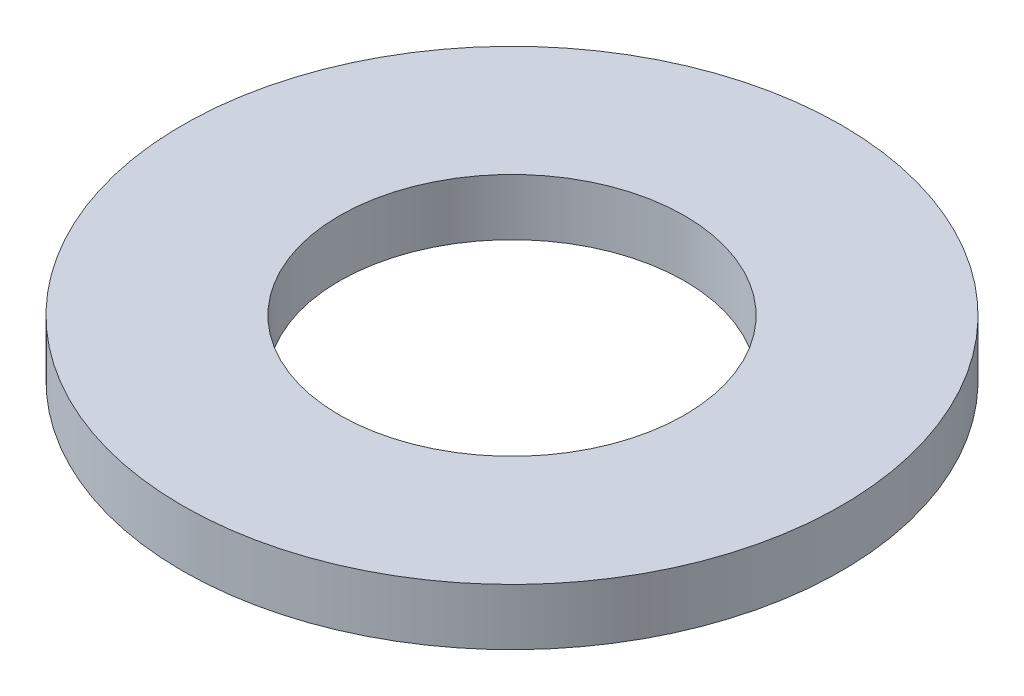
ISO-10303-21;
HEADER;
FILE_DESCRIPTION(('STEP AP214'),'2;1');
FILE_NAME('part.step','',(''),(''),'','','');
FILE_SCHEMA(('AUTOMOTIVE_DESIGN { 1 0 10303 214 1 1 1 1 }'));
ENDSEC;
DATA;
#1=APPLICATION_CONTEXT('core data for automotive mechanical design processes');
#2=APPLICATION_PROTOCOL_DEFINITION('international standard','automotive_design',2000,#1);
#3=PRODUCT_CONTEXT('',#1,'mechanical');
#4=PRODUCT('Part','Part','',(#3));
#5=PRODUCT_RELATED_PRODUCT_CATEGORY('part','',(#4));
#6=PRODUCT_DEFINITION_FORMATION('','',#4);
#7=PRODUCT_DEFINITION_CONTEXT('part definition',#1,'design');
#8=PRODUCT_DEFINITION('design','',#6,#7);
#9=PRODUCT_DEFINITION_SHAPE('','',#8);
#10=(LENGTH_UNIT() NAMED_UNIT(*) SI_UNIT(.MILLI.,.METRE.));
#11=(NAMED_UNIT(*) PLANE_ANGLE_UNIT() SI_UNIT($,.RADIAN.));
#12=(NAMED_UNIT(*) SI_UNIT($,.STERADIAN.) SOLID_ANGLE_UNIT());
#13=UNCERTAINTY_MEASURE_WITH_UNIT(LENGTH_MEASURE(1.E-05),#10,'distance_accuracy_value','');
#14=(GEOMETRIC_REPRESENTATION_CONTEXT(3) GLOBAL_UNCERTAINTY_ASSIGNED_CONTEXT((#13)) GLOBAL_UNIT_ASSIGNED_CONTEXT((#10,
#11,#12)) REPRESENTATION_CONTEXT('',''));
#15=CARTESIAN_POINT('',(0.,0.,0.));
#16=DIRECTION('',(0.,0.,1.));
#17=DIRECTION('',(1.,0.,0.));
#18=AXIS2_PLACEMENT_3D('',#15,#16,#17);
#19=CARTESIAN_POINT('',(0.,9.,0.));
#20=DIRECTION('',(0.,-1.,0.));
#21=DIRECTION('',(0.,0.,-1.));
#22=AXIS2_PLACEMENT_3D('',#19,#20,#21);
#23=CYLINDRICAL_SURFACE('',#22,52.5);
#24=CARTESIAN_POINT('',(0.,9.,0.));
#25=DIRECTION('',(0.,1.,0.));
#26=DIRECTION('',(0.,0.,1.));
#27=AXIS2_PLACEMENT_3D('',#24,#25,#26);
#28=CIRCLE('',#27,52.5);
#29=CARTESIAN_POINT('',(0.,9.,52.5));
#30=VERTEX_POINT('',#29);
#31=EDGE_CURVE('E10',#30,#30,#28,.T.);
#32=ORIENTED_EDGE('',*,*,#31,.F.);
#33=EDGE_LOOP('',(#32));
#34=FACE_BOUND('',#33,.T.);
#35=CARTESIAN_POINT('',(0.,0.,0.));
#36=DIRECTION('',(0.,1.,0.));
#37=DIRECTION('',(0.,0.,1.));
#38=AXIS2_PLACEMENT_3D('',#35,#36,#37);
#39=CIRCLE('',#38,52.5);
#40=CARTESIAN_POINT('',(0.,0.,52.5));
#41=VERTEX_POINT('',#40);
#42=EDGE_CURVE('E37',#41,#41,#39,.T.);
#43=ORIENTED_EDGE('',*,*,#42,.T.);
#44=EDGE_LOOP('',(#43));
#45=FACE_BOUND('',#44,.T.);
#46=ADVANCED_FACE('F40',(#34,#45),#23,.T.);
#47=CARTESIAN_POINT('',(0.,9.,0.));
#48=DIRECTION('',(0.,1.,0.));
#49=DIRECTION('',(0.,0.,1.));
#50=AXIS2_PLACEMENT_3D('',#47,#48,#49);
#51=PLANE('',#50);
#52=CARTESIAN_POINT('',(0.,9.,0.));
#53=DIRECTION('',(0.,1.,0.));
#54=DIRECTION('',(0.,0.,1.));
#55=AXIS2_PLACEMENT_3D('',#52,#53,#54);
#56=CIRCLE('',#55,27.5);
#57=CARTESIAN_POINT('',(0.,9.,27.5));
#58=VERTEX_POINT('',#57);
#59=EDGE_CURVE('E50',#58,#58,#56,.T.);
#60=ORIENTED_EDGE('',*,*,#59,.F.);
#61=EDGE_LOOP('',(#60));
#62=FACE_BOUND('',#61,.T.);
#63=ORIENTED_EDGE('',*,*,#31,.T.);
#64=EDGE_LOOP('',(#63));
#65=FACE_BOUND('',#64,.T.);
#66=ADVANCED_FACE('F59',(#62,#65),#51,.T.);
#67=CARTESIAN_POINT('',(0.,0.,0.));
#68=DIRECTION('',(0.,1.,0.));
#69=DIRECTION('',(0.,0.,1.));
#70=AXIS2_PLACEMENT_3D('',#67,#68,#69);
#71=PLANE('',#70);
#72=CARTESIAN_POINT('',(0.,0.,0.));
#73=DIRECTION('',(0.,1.,0.));
#74=DIRECTION('',(0.,0.,1.));
#75=AXIS2_PLACEMENT_3D('',#72,#73,#74);
#76=CIRCLE('',#75,27.5);
#77=CARTESIAN_POINT('',(0.,0.,27.5));
#78=VERTEX_POINT('',#77);
#79=EDGE_CURVE('E47',#78,#78,#76,.T.);
#80=ORIENTED_EDGE('',*,*,#79,.T.);
#81=EDGE_LOOP('',(#80));
#82=FACE_BOUND('',#81,.T.);
#83=ORIENTED_EDGE('',*,*,#42,.F.);
#84=EDGE_LOOP('',(#83));
#85=FACE_BOUND('',#84,.T.);
#86=ADVANCED_FACE('F58',(#82,#85),#71,.F.);
#87=CARTESIAN_POINT('',(0.,9.,0.));
#88=DIRECTION('',(0.,-1.,0.));
#89=DIRECTION('',(0.,0.,-1.));
#90=AXIS2_PLACEMENT_3D('',#87,#88,#89);
#91=CYLINDRICAL_SURFACE('',#90,27.5);
#92=ORIENTED_EDGE('',*,*,#59,.T.);
#93=EDGE_LOOP('',(#92));
#94=FACE_BOUND('',#93,.T.);
#95=ORIENTED_EDGE('',*,*,#79,.F.);
#96=EDGE_LOOP('',(#95));
#97=FACE_BOUND('',#96,.T.);
#98=ADVANCED_FACE('F54',(#94,#97),#91,.F.);
#99=CLOSED_SHELL('',(#46,#66,#86,#98));
#100=MANIFOLD_SOLID_BREP('B2',#99);
#101=ADVANCED_BREP_SHAPE_REPRESENTATION('',(#18,#100),#14);
#102=SHAPE_DEFINITION_REPRESENTATION(#9,#101);
ENDSEC;
END-ISO-10303-21;
